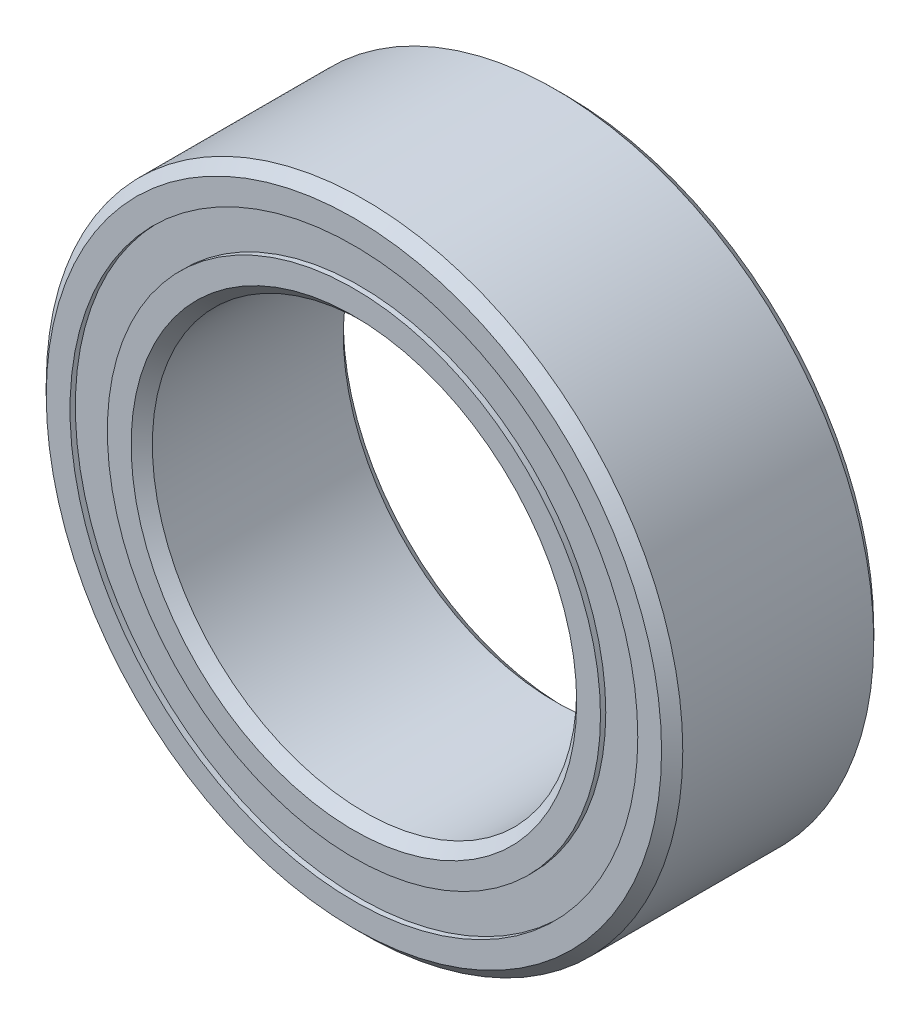
ISO-10303-21;
HEADER;
FILE_DESCRIPTION(('STEP AP214'),'2;1');
FILE_NAME('part.step','',(''),(''),'','','');
FILE_SCHEMA(('AUTOMOTIVE_DESIGN { 1 0 10303 214 1 1 1 1 }'));
ENDSEC;
DATA;
#1=APPLICATION_CONTEXT('core data for automotive mechanical design processes');
#2=APPLICATION_PROTOCOL_DEFINITION('international standard','automotive_design',2000,#1);
#3=PRODUCT_CONTEXT('',#1,'mechanical');
#4=PRODUCT('Part','Part','',(#3));
#5=PRODUCT_RELATED_PRODUCT_CATEGORY('part','',(#4));
#6=PRODUCT_DEFINITION_FORMATION('','',#4);
#7=PRODUCT_DEFINITION_CONTEXT('part definition',#1,'design');
#8=PRODUCT_DEFINITION('design','',#6,#7);
#9=PRODUCT_DEFINITION_SHAPE('','',#8);
#10=(LENGTH_UNIT() NAMED_UNIT(*) SI_UNIT(.MILLI.,.METRE.));
#11=(NAMED_UNIT(*) PLANE_ANGLE_UNIT() SI_UNIT($,.RADIAN.));
#12=(NAMED_UNIT(*) SI_UNIT($,.STERADIAN.) SOLID_ANGLE_UNIT());
#13=UNCERTAINTY_MEASURE_WITH_UNIT(LENGTH_MEASURE(1.E-05),#10,'distance_accuracy_value','');
#14=(GEOMETRIC_REPRESENTATION_CONTEXT(3) GLOBAL_UNCERTAINTY_ASSIGNED_CONTEXT((#13)) GLOBAL_UNIT_ASSIGNED_CONTEXT((#10,
#11,#12)) REPRESENTATION_CONTEXT('',''));
#15=CARTESIAN_POINT('',(0.,0.,0.));
#16=DIRECTION('',(0.,0.,1.));
#17=DIRECTION('',(1.,0.,0.));
#18=AXIS2_PLACEMENT_3D('',#15,#16,#17);
#19=CARTESIAN_POINT('',(3.96875,0.,0.));
#20=DIRECTION('',(1.,0.,0.));
#21=DIRECTION('',(0.,0.,-1.));
#22=AXIS2_PLACEMENT_3D('',#19,#20,#21);
#23=SPHERICAL_SURFACE('',#22,0.758760243513404);
#24=CARTESIAN_POINT('',(3.2099897564866,0.,0.));
#25=VERTEX_POINT('',#24);
#26=VERTEX_LOOP('',#25);
#27=FACE_BOUND('',#26,.T.);
#28=CARTESIAN_POINT('',(4.7275102435134,0.,0.));
#29=VERTEX_POINT('',#28);
#30=VERTEX_LOOP('',#29);
#31=FACE_BOUND('',#30,.T.);
#32=ADVANCED_FACE('P0_F16',(#27,#31),#23,.T.);
#33=CLOSED_SHELL('',(#32));
#34=MANIFOLD_SOLID_BREP('P0_B1',#33);
#35=CARTESIAN_POINT('',(0.,3.96875,0.));
#36=DIRECTION('',(0.,1.,0.));
#37=DIRECTION('',(0.,0.,-1.));
#38=AXIS2_PLACEMENT_3D('',#35,#36,#37);
#39=SPHERICAL_SURFACE('',#38,0.758760243513404);
#40=CARTESIAN_POINT('',(0.,3.2099897564866,0.));
#41=VERTEX_POINT('',#40);
#42=VERTEX_LOOP('',#41);
#43=FACE_BOUND('',#42,.T.);
#44=CARTESIAN_POINT('',(0.,4.7275102435134,0.));
#45=VERTEX_POINT('',#44);
#46=VERTEX_LOOP('',#45);
#47=FACE_BOUND('',#46,.T.);
#48=ADVANCED_FACE('P1_F16',(#43,#47),#39,.T.);
#49=CLOSED_SHELL('',(#48));
#50=MANIFOLD_SOLID_BREP('P1_B1',#49);
#51=CARTESIAN_POINT('',(0.,0.,0.));
#52=DIRECTION('',(0.,0.,1.));
#53=DIRECTION('',(1.,0.,0.));
#54=AXIS2_PLACEMENT_3D('',#51,#52,#53);
#55=TOROIDAL_SURFACE('',#54,3.96875,0.758760243513404);
#56=CARTESIAN_POINT('',(0.,0.,-0.705555555555556));
#57=DIRECTION('',(0.,0.,1.));
#58=DIRECTION('',(1.,0.,0.));
#59=AXIS2_PLACEMENT_3D('',#56,#57,#58);
#60=CIRCLE('',#59,4.24787087912088);
#61=CARTESIAN_POINT('',(4.24787087912088,0.,-0.705555555555556));
#62=VERTEX_POINT('',#61);
#63=EDGE_CURVE('P2_E33',#62,#62,#60,.F.);
#64=ORIENTED_EDGE('',*,*,#63,.T.);
#65=EDGE_LOOP('',(#64));
#66=FACE_BOUND('',#65,.T.);
#67=CARTESIAN_POINT('',(0.,0.,0.705555555555555));
#68=DIRECTION('',(0.,0.,1.));
#69=DIRECTION('',(1.,0.,0.));
#70=AXIS2_PLACEMENT_3D('',#67,#68,#69);
#71=CIRCLE('',#70,4.24787087912088);
#72=CARTESIAN_POINT('',(4.24787087912088,0.,0.705555555555555));
#73=VERTEX_POINT('',#72);
#74=EDGE_CURVE('P2_E31',#73,#73,#71,.T.);
#75=ORIENTED_EDGE('',*,*,#74,.T.);
#76=EDGE_LOOP('',(#75));
#77=FACE_BOUND('',#76,.T.);
#78=ADVANCED_FACE('P2_F15',(#66,#77),#55,.F.);
#79=CARTESIAN_POINT('',(0.,0.,1.5875));
#80=DIRECTION('',(0.,0.,1.));
#81=DIRECTION('',(1.,0.,0.));
#82=AXIS2_PLACEMENT_3D('',#79,#80,#81);
#83=CYLINDRICAL_SURFACE('',#82,4.24787087912088);
#84=CARTESIAN_POINT('',(0.,0.,-1.5875));
#85=DIRECTION('',(0.,0.,1.));
#86=DIRECTION('',(1.,0.,0.));
#87=AXIS2_PLACEMENT_3D('',#84,#85,#86);
#88=CIRCLE('',#87,4.24787087912088);
#89=CARTESIAN_POINT('',(4.24787087912088,0.,-1.5875));
#90=VERTEX_POINT('',#89);
#91=EDGE_CURVE('P2_E19',#90,#90,#88,.F.);
#92=ORIENTED_EDGE('',*,*,#91,.T.);
#93=EDGE_LOOP('',(#92));
#94=FACE_BOUND('',#93,.T.);
#95=ORIENTED_EDGE('',*,*,#63,.F.);
#96=EDGE_LOOP('',(#95));
#97=FACE_BOUND('',#96,.T.);
#98=ADVANCED_FACE('P2_F49',(#94,#97),#83,.F.);
#99=CARTESIAN_POINT('',(0.,0.,1.5875));
#100=DIRECTION('',(0.,0.,1.));
#101=DIRECTION('',(1.,0.,0.));
#102=AXIS2_PLACEMENT_3D('',#99,#100,#101);
#103=CYLINDRICAL_SURFACE('',#102,4.24787087912088);
#104=ORIENTED_EDGE('',*,*,#74,.F.);
#105=EDGE_LOOP('',(#104));
#106=FACE_BOUND('',#105,.T.);
#107=CARTESIAN_POINT('',(0.,0.,1.5875));
#108=DIRECTION('',(0.,0.,1.));
#109=DIRECTION('',(1.,0.,0.));
#110=AXIS2_PLACEMENT_3D('',#107,#108,#109);
#111=CIRCLE('',#110,4.24787087912088);
#112=CARTESIAN_POINT('',(4.24787087912088,0.,1.5875));
#113=VERTEX_POINT('',#112);
#114=EDGE_CURVE('P2_E42',#113,#113,#111,.T.);
#115=ORIENTED_EDGE('',*,*,#114,.T.);
#116=EDGE_LOOP('',(#115));
#117=FACE_BOUND('',#116,.T.);
#118=ADVANCED_FACE('P2_F56',(#106,#117),#103,.F.);
#119=CARTESIAN_POINT('',(0.,4.60375,-1.5875));
#120=DIRECTION('',(0.,0.,1.));
#121=DIRECTION('',(1.,0.,0.));
#122=AXIS2_PLACEMENT_3D('',#119,#120,#121);
#123=PLANE('',#122);
#124=ORIENTED_EDGE('',*,*,#91,.F.);
#125=EDGE_LOOP('',(#124));
#126=FACE_BOUND('',#125,.T.);
#127=CARTESIAN_POINT('',(0.,0.,-1.58750000002783));
#128=DIRECTION('',(0.,0.,1.));
#129=DIRECTION('',(1.,0.,0.));
#130=AXIS2_PLACEMENT_3D('',#127,#128,#129);
#131=CIRCLE('',#130,4.60375000000113);
#132=CARTESIAN_POINT('',(4.60375000000113,0.,-1.58750000002783));
#133=VERTEX_POINT('',#132);
#134=EDGE_CURVE('P2_E40',#133,#133,#131,.T.);
#135=ORIENTED_EDGE('',*,*,#134,.F.);
#136=EDGE_LOOP('',(#135));
#137=FACE_BOUND('',#136,.T.);
#138=ADVANCED_FACE('P2_F52',(#126,#137),#123,.F.);
#139=CARTESIAN_POINT('',(0.,4.60375,1.5875));
#140=DIRECTION('',(0.,0.,-1.));
#141=DIRECTION('',(-1.,0.,0.));
#142=AXIS2_PLACEMENT_3D('',#139,#140,#141);
#143=PLANE('',#142);
#144=CARTESIAN_POINT('',(0.,0.,1.58750000008467));
#145=DIRECTION('',(0.,0.,-1.));
#146=DIRECTION('',(-1.,0.,0.));
#147=AXIS2_PLACEMENT_3D('',#144,#145,#146);
#148=CIRCLE('',#147,4.60375000000113);
#149=CARTESIAN_POINT('',(-4.60375000000113,0.,1.58750000008467));
#150=VERTEX_POINT('',#149);
#151=EDGE_CURVE('P2_E28',#150,#150,#148,.T.);
#152=ORIENTED_EDGE('',*,*,#151,.F.);
#153=EDGE_LOOP('',(#152));
#154=FACE_BOUND('',#153,.T.);
#155=ORIENTED_EDGE('',*,*,#114,.F.);
#156=EDGE_LOOP('',(#155));
#157=FACE_BOUND('',#156,.T.);
#158=ADVANCED_FACE('P2_F55',(#154,#157),#143,.F.);
#159=CARTESIAN_POINT('',(0.,0.,-1.42874999994547));
#160=DIRECTION('',(0.,0.,1.));
#161=DIRECTION('',(1.,0.,0.));
#162=AXIS2_PLACEMENT_3D('',#159,#160,#161);
#163=CONICAL_SURFACE('',#162,4.76250000002665,0.785398163218414);
#164=CARTESIAN_POINT('',(0.,0.,-1.42875));
#165=DIRECTION('',(0.,0.,1.));
#166=DIRECTION('',(1.,0.,0.));
#167=AXIS2_PLACEMENT_3D('',#164,#165,#166);
#168=CIRCLE('',#167,4.7625);
#169=CARTESIAN_POINT('',(4.7625,0.,-1.42875));
#170=VERTEX_POINT('',#169);
#171=EDGE_CURVE('P2_E23',#170,#170,#168,.T.);
#172=ORIENTED_EDGE('',*,*,#171,.F.);
#173=EDGE_LOOP('',(#172));
#174=FACE_BOUND('',#173,.T.);
#175=ORIENTED_EDGE('',*,*,#134,.T.);
#176=EDGE_LOOP('',(#175));
#177=FACE_BOUND('',#176,.T.);
#178=ADVANCED_FACE('P2_F60',(#174,#177),#163,.T.);
#179=CARTESIAN_POINT('',(0.,0.,1.42875000005915));
#180=DIRECTION('',(0.,0.,-1.));
#181=DIRECTION('',(-1.,0.,0.));
#182=AXIS2_PLACEMENT_3D('',#179,#180,#181);
#183=CONICAL_SURFACE('',#182,4.7624999999698,0.785398163218414);
#184=CARTESIAN_POINT('',(0.,0.,1.42875));
#185=DIRECTION('',(0.,0.,1.));
#186=DIRECTION('',(1.,0.,0.));
#187=AXIS2_PLACEMENT_3D('',#184,#185,#186);
#188=CIRCLE('',#187,4.7625);
#189=CARTESIAN_POINT('',(4.7625,0.,1.42875));
#190=VERTEX_POINT('',#189);
#191=EDGE_CURVE('P2_E10',#190,#190,#188,.F.);
#192=ORIENTED_EDGE('',*,*,#191,.F.);
#193=EDGE_LOOP('',(#192));
#194=FACE_BOUND('',#193,.T.);
#195=ORIENTED_EDGE('',*,*,#151,.T.);
#196=EDGE_LOOP('',(#195));
#197=FACE_BOUND('',#196,.T.);
#198=ADVANCED_FACE('P2_F62',(#194,#197),#183,.T.);
#199=CARTESIAN_POINT('',(0.,0.,1.5875));
#200=DIRECTION('',(0.,0.,1.));
#201=DIRECTION('',(1.,0.,0.));
#202=AXIS2_PLACEMENT_3D('',#199,#200,#201);
#203=CYLINDRICAL_SURFACE('',#202,4.7625);
#204=ORIENTED_EDGE('',*,*,#191,.T.);
#205=EDGE_LOOP('',(#204));
#206=FACE_BOUND('',#205,.T.);
#207=ORIENTED_EDGE('',*,*,#171,.T.);
#208=EDGE_LOOP('',(#207));
#209=FACE_BOUND('',#208,.T.);
#210=ADVANCED_FACE('P2_F70',(#206,#209),#203,.T.);
#211=CLOSED_SHELL('',(#78,#98,#118,#138,#158,#178,#198,#210));
#212=MANIFOLD_SOLID_BREP('P2_B1',#211);
#213=CARTESIAN_POINT('',(1.98437499999998,-3.4370383212695,0.));
#214=DIRECTION('',(0.499999999999995,-0.866025403784442,0.));
#215=DIRECTION('',(0.,0.,-1.));
#216=AXIS2_PLACEMENT_3D('',#213,#214,#215);
#217=SPHERICAL_SURFACE('',#216,0.758760243513404);
#218=CARTESIAN_POINT('',(2.36375512175668,-4.09414396753378,0.));
#219=VERTEX_POINT('',#218);
#220=VERTEX_LOOP('',#219);
#221=FACE_BOUND('',#220,.T.);
#222=CARTESIAN_POINT('',(1.60499487824328,-2.77993267500523,0.));
#223=VERTEX_POINT('',#222);
#224=VERTEX_LOOP('',#223);
#225=FACE_BOUND('',#224,.T.);
#226=ADVANCED_FACE('P3_F15',(#221,#225),#217,.T.);
#227=CLOSED_SHELL('',(#226));
#228=MANIFOLD_SOLID_BREP('P3_B1',#227);
#229=CARTESIAN_POINT('',(-3.96875,0.,0.));
#230=DIRECTION('',(-1.,0.,0.));
#231=DIRECTION('',(0.,0.,-1.));
#232=AXIS2_PLACEMENT_3D('',#229,#230,#231);
#233=SPHERICAL_SURFACE('',#232,0.758760243513404);
#234=CARTESIAN_POINT('',(-4.7275102435134,0.,0.));
#235=VERTEX_POINT('',#234);
#236=VERTEX_LOOP('',#235);
#237=FACE_BOUND('',#236,.T.);
#238=CARTESIAN_POINT('',(-3.2099897564866,0.,0.));
#239=VERTEX_POINT('',#238);
#240=VERTEX_LOOP('',#239);
#241=FACE_BOUND('',#240,.T.);
#242=ADVANCED_FACE('P4_F16',(#237,#241),#233,.T.);
#243=CLOSED_SHELL('',(#242));
#244=MANIFOLD_SOLID_BREP('P4_B1',#243);
#245=CARTESIAN_POINT('',(-3.43703832126951,-1.98437499999997,0.));
#246=DIRECTION('',(-0.866025403784443,-0.499999999999992,0.));
#247=DIRECTION('',(0.,0.,-1.));
#248=AXIS2_PLACEMENT_3D('',#245,#246,#247);
#249=SPHERICAL_SURFACE('',#248,0.758760243513404);
#250=CARTESIAN_POINT('',(-4.09414396753379,-2.36375512175666,0.));
#251=VERTEX_POINT('',#250);
#252=VERTEX_LOOP('',#251);
#253=FACE_BOUND('',#252,.T.);
#254=CARTESIAN_POINT('',(-2.77993267500523,-1.60499487824327,0.));
#255=VERTEX_POINT('',#254);
#256=VERTEX_LOOP('',#255);
#257=FACE_BOUND('',#256,.T.);
#258=ADVANCED_FACE('P5_F16',(#253,#257),#249,.T.);
#259=CLOSED_SHELL('',(#258));
#260=MANIFOLD_SOLID_BREP('P5_B1',#259);
#261=CARTESIAN_POINT('',(1.984375,3.43703832126949,0.));
#262=DIRECTION('',(0.500000000000001,0.866025403784438,0.));
#263=DIRECTION('',(0.,0.,-1.));
#264=AXIS2_PLACEMENT_3D('',#261,#262,#263);
#265=SPHERICAL_SURFACE('',#264,0.758760243513404);
#266=CARTESIAN_POINT('',(2.36375512175671,4.09414396753376,0.));
#267=VERTEX_POINT('',#266);
#268=VERTEX_LOOP('',#267);
#269=FACE_BOUND('',#268,.T.);
#270=CARTESIAN_POINT('',(1.6049948782433,2.77993267500521,0.));
#271=VERTEX_POINT('',#270);
#272=VERTEX_LOOP('',#271);
#273=FACE_BOUND('',#272,.T.);
#274=ADVANCED_FACE('P6_F16',(#269,#273),#265,.T.);
#275=CLOSED_SHELL('',(#274));
#276=MANIFOLD_SOLID_BREP('P6_B1',#275);
#277=CARTESIAN_POINT('',(-1.98437499999996,3.43703832126952,0.));
#278=DIRECTION('',(-0.499999999999989,0.866025403784445,0.));
#279=DIRECTION('',(0.,0.,-1.));
#280=AXIS2_PLACEMENT_3D('',#277,#278,#279);
#281=SPHERICAL_SURFACE('',#280,0.758760243513404);
#282=CARTESIAN_POINT('',(-2.36375512175665,4.0941439675338,0.));
#283=VERTEX_POINT('',#282);
#284=VERTEX_LOOP('',#283);
#285=FACE_BOUND('',#284,.T.);
#286=CARTESIAN_POINT('',(-1.60499487824326,2.77993267500524,0.));
#287=VERTEX_POINT('',#286);
#288=VERTEX_LOOP('',#287);
#289=FACE_BOUND('',#288,.T.);
#290=ADVANCED_FACE('P7_F16',(#285,#289),#281,.T.);
#291=CLOSED_SHELL('',(#290));
#292=MANIFOLD_SOLID_BREP('P7_B1',#291);
#293=CARTESIAN_POINT('',(0.,0.,0.));
#294=DIRECTION('',(0.,0.,1.));
#295=DIRECTION('',(1.,0.,0.));
#296=AXIS2_PLACEMENT_3D('',#293,#294,#295);
#297=TOROIDAL_SURFACE('',#296,3.96875,0.758760243513403);
#298=CARTESIAN_POINT('',(0.,0.,0.705555555555556));
#299=DIRECTION('',(0.,0.,1.));
#300=DIRECTION('',(1.,0.,0.));
#301=AXIS2_PLACEMENT_3D('',#298,#299,#300);
#302=CIRCLE('',#301,3.68962912087912);
#303=CARTESIAN_POINT('',(3.68962912087912,0.,0.705555555555556));
#304=VERTEX_POINT('',#303);
#305=EDGE_CURVE('P8_E33',#304,#304,#302,.T.);
#306=ORIENTED_EDGE('',*,*,#305,.F.);
#307=EDGE_LOOP('',(#306));
#308=FACE_BOUND('',#307,.T.);
#309=CARTESIAN_POINT('',(0.,0.,-0.705555555555556));
#310=DIRECTION('',(0.,0.,1.));
#311=DIRECTION('',(1.,0.,0.));
#312=AXIS2_PLACEMENT_3D('',#309,#310,#311);
#313=CIRCLE('',#312,3.68962912087912);
#314=CARTESIAN_POINT('',(3.68962912087912,0.,-0.705555555555556));
#315=VERTEX_POINT('',#314);
#316=EDGE_CURVE('P8_E31',#315,#315,#313,.F.);
#317=ORIENTED_EDGE('',*,*,#316,.F.);
#318=EDGE_LOOP('',(#317));
#319=FACE_BOUND('',#318,.T.);
#320=ADVANCED_FACE('P8_F15',(#308,#319),#297,.F.);
#321=CARTESIAN_POINT('',(0.,0.,1.5875));
#322=DIRECTION('',(0.,0.,1.));
#323=DIRECTION('',(1.,0.,0.));
#324=AXIS2_PLACEMENT_3D('',#321,#322,#323);
#325=CYLINDRICAL_SURFACE('',#324,3.68962912087912);
#326=CARTESIAN_POINT('',(0.,0.,1.5875));
#327=DIRECTION('',(0.,0.,1.));
#328=DIRECTION('',(1.,0.,0.));
#329=AXIS2_PLACEMENT_3D('',#326,#327,#328);
#330=CIRCLE('',#329,3.68962912087912);
#331=CARTESIAN_POINT('',(3.68962912087912,0.,1.5875));
#332=VERTEX_POINT('',#331);
#333=EDGE_CURVE('P8_E19',#332,#332,#330,.F.);
#334=ORIENTED_EDGE('',*,*,#333,.T.);
#335=EDGE_LOOP('',(#334));
#336=FACE_BOUND('',#335,.T.);
#337=ORIENTED_EDGE('',*,*,#305,.T.);
#338=EDGE_LOOP('',(#337));
#339=FACE_BOUND('',#338,.T.);
#340=ADVANCED_FACE('P8_F49',(#336,#339),#325,.T.);
#341=CARTESIAN_POINT('',(0.,0.,1.5875));
#342=DIRECTION('',(0.,0.,1.));
#343=DIRECTION('',(1.,0.,0.));
#344=AXIS2_PLACEMENT_3D('',#341,#342,#343);
#345=CYLINDRICAL_SURFACE('',#344,3.68962912087912);
#346=ORIENTED_EDGE('',*,*,#316,.T.);
#347=EDGE_LOOP('',(#346));
#348=FACE_BOUND('',#347,.T.);
#349=CARTESIAN_POINT('',(0.,0.,-1.5875));
#350=DIRECTION('',(0.,0.,1.));
#351=DIRECTION('',(1.,0.,0.));
#352=AXIS2_PLACEMENT_3D('',#349,#350,#351);
#353=CIRCLE('',#352,3.68962912087912);
#354=CARTESIAN_POINT('',(3.68962912087912,0.,-1.5875));
#355=VERTEX_POINT('',#354);
#356=EDGE_CURVE('P8_E42',#355,#355,#353,.T.);
#357=ORIENTED_EDGE('',*,*,#356,.T.);
#358=EDGE_LOOP('',(#357));
#359=FACE_BOUND('',#358,.T.);
#360=ADVANCED_FACE('P8_F56',(#348,#359),#345,.T.);
#361=CARTESIAN_POINT('',(0.,3.68962912087912,1.5875));
#362=DIRECTION('',(0.,0.,-1.));
#363=DIRECTION('',(-1.,0.,0.));
#364=AXIS2_PLACEMENT_3D('',#361,#362,#363);
#365=PLANE('',#364);
#366=ORIENTED_EDGE('',*,*,#333,.F.);
#367=EDGE_LOOP('',(#366));
#368=FACE_BOUND('',#367,.T.);
#369=CARTESIAN_POINT('',(0.,0.,1.58749999997099));
#370=DIRECTION('',(0.,0.,1.));
#371=DIRECTION('',(1.,0.,0.));
#372=AXIS2_PLACEMENT_3D('',#369,#370,#371);
#373=CIRCLE('',#372,3.33374999996749);
#374=CARTESIAN_POINT('',(3.33374999996749,0.,1.58749999997099));
#375=VERTEX_POINT('',#374);
#376=EDGE_CURVE('P8_E40',#375,#375,#373,.F.);
#377=ORIENTED_EDGE('',*,*,#376,.T.);
#378=EDGE_LOOP('',(#377));
#379=FACE_BOUND('',#378,.T.);
#380=ADVANCED_FACE('P8_F52',(#368,#379),#365,.F.);
#381=CARTESIAN_POINT('',(0.,3.33375,-1.5875));
#382=DIRECTION('',(0.,0.,1.));
#383=DIRECTION('',(1.,0.,0.));
#384=AXIS2_PLACEMENT_3D('',#381,#382,#383);
#385=PLANE('',#384);
#386=CARTESIAN_POINT('',(0.,0.,-1.58749999997099));
#387=DIRECTION('',(0.,0.,-1.));
#388=DIRECTION('',(0.,1.,0.));
#389=AXIS2_PLACEMENT_3D('',#386,#387,#388);
#390=CIRCLE('',#389,3.33375000002434);
#391=CARTESIAN_POINT('',(0.,3.33375000002434,-1.58749999997099));
#392=VERTEX_POINT('',#391);
#393=EDGE_CURVE('P8_E28',#392,#392,#390,.F.);
#394=ORIENTED_EDGE('',*,*,#393,.T.);
#395=EDGE_LOOP('',(#394));
#396=FACE_BOUND('',#395,.T.);
#397=ORIENTED_EDGE('',*,*,#356,.F.);
#398=EDGE_LOOP('',(#397));
#399=FACE_BOUND('',#398,.T.);
#400=ADVANCED_FACE('P8_F55',(#396,#399),#385,.F.);
#401=CARTESIAN_POINT('',(0.,0.,1.58749999991414));
#402=DIRECTION('',(0.,0.,1.));
#403=DIRECTION('',(1.,0.,0.));
#404=AXIS2_PLACEMENT_3D('',#401,#402,#403);
#405=CONICAL_SURFACE('',#404,3.33374999991065,0.785398163397448);
#406=ORIENTED_EDGE('',*,*,#376,.F.);
#407=EDGE_LOOP('',(#406));
#408=FACE_BOUND('',#407,.T.);
#409=CARTESIAN_POINT('',(0.,0.,1.42875));
#410=DIRECTION('',(0.,0.,1.));
#411=DIRECTION('',(1.,0.,0.));
#412=AXIS2_PLACEMENT_3D('',#409,#410,#411);
#413=CIRCLE('',#412,3.175);
#414=CARTESIAN_POINT('',(3.175,0.,1.42875));
#415=VERTEX_POINT('',#414);
#416=EDGE_CURVE('P8_E23',#415,#415,#413,.F.);
#417=ORIENTED_EDGE('',*,*,#416,.T.);
#418=EDGE_LOOP('',(#417));
#419=FACE_BOUND('',#418,.T.);
#420=ADVANCED_FACE('P8_F60',(#408,#419),#405,.F.);
#421=CARTESIAN_POINT('',(0.,0.,-1.58749999997099));
#422=DIRECTION('',(0.,0.,-1.));
#423=DIRECTION('',(0.,1.,0.));
#424=AXIS2_PLACEMENT_3D('',#421,#422,#423);
#425=CONICAL_SURFACE('',#424,3.33375000002434,0.785398163397448);
#426=CARTESIAN_POINT('',(0.,0.,-1.42875));
#427=DIRECTION('',(0.,0.,1.));
#428=DIRECTION('',(1.,0.,0.));
#429=AXIS2_PLACEMENT_3D('',#426,#427,#428);
#430=CIRCLE('',#429,3.175);
#431=CARTESIAN_POINT('',(3.175,0.,-1.42875));
#432=VERTEX_POINT('',#431);
#433=EDGE_CURVE('P8_E10',#432,#432,#430,.T.);
#434=ORIENTED_EDGE('',*,*,#433,.T.);
#435=EDGE_LOOP('',(#434));
#436=FACE_BOUND('',#435,.T.);
#437=ORIENTED_EDGE('',*,*,#393,.F.);
#438=EDGE_LOOP('',(#437));
#439=FACE_BOUND('',#438,.T.);
#440=ADVANCED_FACE('P8_F63',(#436,#439),#425,.F.);
#441=CARTESIAN_POINT('',(0.,0.,1.5875));
#442=DIRECTION('',(0.,0.,1.));
#443=DIRECTION('',(1.,0.,0.));
#444=AXIS2_PLACEMENT_3D('',#441,#442,#443);
#445=CYLINDRICAL_SURFACE('',#444,3.175);
#446=ORIENTED_EDGE('',*,*,#416,.F.);
#447=EDGE_LOOP('',(#446));
#448=FACE_BOUND('',#447,.T.);
#449=ORIENTED_EDGE('',*,*,#433,.F.);
#450=EDGE_LOOP('',(#449));
#451=FACE_BOUND('',#450,.T.);
#452=ADVANCED_FACE('P8_F67',(#448,#451),#445,.F.);
#453=CLOSED_SHELL('',(#320,#340,#360,#380,#400,#420,#440,#452));
#454=MANIFOLD_SOLID_BREP('P8_B1',#453);
#455=CARTESIAN_POINT('',(0.,4.24787087912088,-1.508125));
#456=DIRECTION('',(0.,0.,1.));
#457=DIRECTION('',(1.,0.,0.));
#458=AXIS2_PLACEMENT_3D('',#455,#456,#457);
#459=PLANE('',#458);
#460=CARTESIAN_POINT('',(0.,0.,-1.508125));
#461=DIRECTION('',(0.,0.,1.));
#462=DIRECTION('',(1.,0.,0.));
#463=AXIS2_PLACEMENT_3D('',#460,#461,#462);
#464=CIRCLE('',#463,3.68962912087912);
#465=CARTESIAN_POINT('',(3.68962912087912,0.,-1.508125));
#466=VERTEX_POINT('',#465);
#467=EDGE_CURVE('P9_E18',#466,#466,#464,.T.);
#468=ORIENTED_EDGE('',*,*,#467,.T.);
#469=EDGE_LOOP('',(#468));
#470=FACE_BOUND('',#469,.T.);
#471=CARTESIAN_POINT('',(0.,0.,-1.508125));
#472=DIRECTION('',(0.,0.,1.));
#473=DIRECTION('',(1.,0.,0.));
#474=AXIS2_PLACEMENT_3D('',#471,#472,#473);
#475=CIRCLE('',#474,4.24787087912088);
#476=CARTESIAN_POINT('',(4.24787087912088,0.,-1.508125));
#477=VERTEX_POINT('',#476);
#478=EDGE_CURVE('P9_E27',#477,#477,#475,.T.);
#479=ORIENTED_EDGE('',*,*,#478,.F.);
#480=EDGE_LOOP('',(#479));
#481=FACE_BOUND('',#480,.T.);
#482=ADVANCED_FACE('P9_F15',(#470,#481),#459,.F.);
#483=CARTESIAN_POINT('',(0.,0.,1.5875));
#484=DIRECTION('',(0.,0.,1.));
#485=DIRECTION('',(1.,0.,0.));
#486=AXIS2_PLACEMENT_3D('',#483,#484,#485);
#487=CYLINDRICAL_SURFACE('',#486,3.68962912087912);
#488=ORIENTED_EDGE('',*,*,#467,.F.);
#489=EDGE_LOOP('',(#488));
#490=FACE_BOUND('',#489,.T.);
#491=CARTESIAN_POINT('',(0.,0.,-0.758760243513405));
#492=DIRECTION('',(0.,0.,1.));
#493=DIRECTION('',(1.,0.,0.));
#494=AXIS2_PLACEMENT_3D('',#491,#492,#493);
#495=CIRCLE('',#494,3.68962912087912);
#496=CARTESIAN_POINT('',(3.68962912087912,0.,-0.758760243513405));
#497=VERTEX_POINT('',#496);
#498=EDGE_CURVE('P9_E22',#497,#497,#495,.T.);
#499=ORIENTED_EDGE('',*,*,#498,.T.);
#500=EDGE_LOOP('',(#499));
#501=FACE_BOUND('',#500,.T.);
#502=ADVANCED_FACE('P9_F37',(#490,#501),#487,.F.);
#503=CARTESIAN_POINT('',(0.,0.,1.5875));
#504=DIRECTION('',(0.,0.,1.));
#505=DIRECTION('',(1.,0.,0.));
#506=AXIS2_PLACEMENT_3D('',#503,#504,#505);
#507=CYLINDRICAL_SURFACE('',#506,4.24787087912088);
#508=CARTESIAN_POINT('',(0.,0.,-0.758760243513404));
#509=DIRECTION('',(0.,0.,1.));
#510=DIRECTION('',(1.,0.,0.));
#511=AXIS2_PLACEMENT_3D('',#508,#509,#510);
#512=CIRCLE('',#511,4.24787087912088);
#513=CARTESIAN_POINT('',(4.24787087912088,0.,-0.758760243513404));
#514=VERTEX_POINT('',#513);
#515=EDGE_CURVE('P9_E10',#514,#514,#512,.F.);
#516=ORIENTED_EDGE('',*,*,#515,.T.);
#517=EDGE_LOOP('',(#516));
#518=FACE_BOUND('',#517,.T.);
#519=ORIENTED_EDGE('',*,*,#478,.T.);
#520=EDGE_LOOP('',(#519));
#521=FACE_BOUND('',#520,.T.);
#522=ADVANCED_FACE('P9_F40',(#518,#521),#507,.T.);
#523=CARTESIAN_POINT('',(0.,4.24787087912088,-0.758760243513404));
#524=DIRECTION('',(0.,0.,-1.));
#525=DIRECTION('',(-1.,0.,0.));
#526=AXIS2_PLACEMENT_3D('',#523,#524,#525);
#527=PLANE('',#526);
#528=ORIENTED_EDGE('',*,*,#515,.F.);
#529=EDGE_LOOP('',(#528));
#530=FACE_BOUND('',#529,.T.);
#531=ORIENTED_EDGE('',*,*,#498,.F.);
#532=EDGE_LOOP('',(#531));
#533=FACE_BOUND('',#532,.T.);
#534=ADVANCED_FACE('P9_F43',(#530,#533),#527,.F.);
#535=CLOSED_SHELL('',(#482,#502,#522,#534));
#536=MANIFOLD_SOLID_BREP('P9_B1',#535);
#537=CARTESIAN_POINT('',(3.4370383212695,1.98437499999999,0.));
#538=DIRECTION('',(0.86602540378444,0.499999999999998,0.));
#539=DIRECTION('',(0.,0.,-1.));
#540=AXIS2_PLACEMENT_3D('',#537,#538,#539);
#541=SPHERICAL_SURFACE('',#540,0.758760243513404);
#542=CARTESIAN_POINT('',(4.09414396753377,2.36375512175669,0.));
#543=VERTEX_POINT('',#542);
#544=VERTEX_LOOP('',#543);
#545=FACE_BOUND('',#544,.T.);
#546=CARTESIAN_POINT('',(2.77993267500522,1.60499487824329,0.));
#547=VERTEX_POINT('',#546);
#548=VERTEX_LOOP('',#547);
#549=FACE_BOUND('',#548,.T.);
#550=ADVANCED_FACE('P10_F16',(#545,#549),#541,.T.);
#551=CLOSED_SHELL('',(#550));
#552=MANIFOLD_SOLID_BREP('P10_B1',#551);
#553=CARTESIAN_POINT('',(0.,4.24787087912088,0.758760243513404));
#554=DIRECTION('',(0.,0.,1.));
#555=DIRECTION('',(1.,0.,0.));
#556=AXIS2_PLACEMENT_3D('',#553,#554,#555);
#557=PLANE('',#556);
#558=CARTESIAN_POINT('',(0.,0.,0.758760243513404));
#559=DIRECTION('',(0.,0.,1.));
#560=DIRECTION('',(1.,0.,0.));
#561=AXIS2_PLACEMENT_3D('',#558,#559,#560);
#562=CIRCLE('',#561,3.68962912087912);
#563=CARTESIAN_POINT('',(3.68962912087912,0.,0.758760243513404));
#564=VERTEX_POINT('',#563);
#565=EDGE_CURVE('P11_E18',#564,#564,#562,.T.);
#566=ORIENTED_EDGE('',*,*,#565,.T.);
#567=EDGE_LOOP('',(#566));
#568=FACE_BOUND('',#567,.T.);
#569=CARTESIAN_POINT('',(0.,0.,0.758760243513404));
#570=DIRECTION('',(0.,0.,1.));
#571=DIRECTION('',(1.,0.,0.));
#572=AXIS2_PLACEMENT_3D('',#569,#570,#571);
#573=CIRCLE('',#572,4.24787087912088);
#574=CARTESIAN_POINT('',(4.24787087912088,0.,0.758760243513404));
#575=VERTEX_POINT('',#574);
#576=EDGE_CURVE('P11_E27',#575,#575,#573,.T.);
#577=ORIENTED_EDGE('',*,*,#576,.F.);
#578=EDGE_LOOP('',(#577));
#579=FACE_BOUND('',#578,.T.);
#580=ADVANCED_FACE('P11_F15',(#568,#579),#557,.F.);
#581=CARTESIAN_POINT('',(0.,0.,1.5875));
#582=DIRECTION('',(0.,0.,1.));
#583=DIRECTION('',(1.,0.,0.));
#584=AXIS2_PLACEMENT_3D('',#581,#582,#583);
#585=CYLINDRICAL_SURFACE('',#584,3.68962912087912);
#586=ORIENTED_EDGE('',*,*,#565,.F.);
#587=EDGE_LOOP('',(#586));
#588=FACE_BOUND('',#587,.T.);
#589=CARTESIAN_POINT('',(0.,0.,1.508125));
#590=DIRECTION('',(0.,0.,1.));
#591=DIRECTION('',(1.,0.,0.));
#592=AXIS2_PLACEMENT_3D('',#589,#590,#591);
#593=CIRCLE('',#592,3.68962912087912);
#594=CARTESIAN_POINT('',(3.68962912087912,0.,1.508125));
#595=VERTEX_POINT('',#594);
#596=EDGE_CURVE('P11_E22',#595,#595,#593,.T.);
#597=ORIENTED_EDGE('',*,*,#596,.T.);
#598=EDGE_LOOP('',(#597));
#599=FACE_BOUND('',#598,.T.);
#600=ADVANCED_FACE('P11_F37',(#588,#599),#585,.F.);
#601=CARTESIAN_POINT('',(0.,0.,1.5875));
#602=DIRECTION('',(0.,0.,1.));
#603=DIRECTION('',(1.,0.,0.));
#604=AXIS2_PLACEMENT_3D('',#601,#602,#603);
#605=CYLINDRICAL_SURFACE('',#604,4.24787087912088);
#606=CARTESIAN_POINT('',(0.,0.,1.508125));
#607=DIRECTION('',(0.,0.,1.));
#608=DIRECTION('',(1.,0.,0.));
#609=AXIS2_PLACEMENT_3D('',#606,#607,#608);
#610=CIRCLE('',#609,4.24787087912088);
#611=CARTESIAN_POINT('',(4.24787087912088,0.,1.508125));
#612=VERTEX_POINT('',#611);
#613=EDGE_CURVE('P11_E10',#612,#612,#610,.F.);
#614=ORIENTED_EDGE('',*,*,#613,.T.);
#615=EDGE_LOOP('',(#614));
#616=FACE_BOUND('',#615,.T.);
#617=ORIENTED_EDGE('',*,*,#576,.T.);
#618=EDGE_LOOP('',(#617));
#619=FACE_BOUND('',#618,.T.);
#620=ADVANCED_FACE('P11_F40',(#616,#619),#605,.T.);
#621=CARTESIAN_POINT('',(0.,4.24787087912088,1.508125));
#622=DIRECTION('',(0.,0.,-1.));
#623=DIRECTION('',(-1.,0.,0.));
#624=AXIS2_PLACEMENT_3D('',#621,#622,#623);
#625=PLANE('',#624);
#626=ORIENTED_EDGE('',*,*,#613,.F.);
#627=EDGE_LOOP('',(#626));
#628=FACE_BOUND('',#627,.T.);
#629=ORIENTED_EDGE('',*,*,#596,.F.);
#630=EDGE_LOOP('',(#629));
#631=FACE_BOUND('',#630,.T.);
#632=ADVANCED_FACE('P11_F43',(#628,#631),#625,.F.);
#633=CLOSED_SHELL('',(#580,#600,#620,#632));
#634=MANIFOLD_SOLID_BREP('P11_B1',#633);
#635=CARTESIAN_POINT('',(-3.43703832126947,1.98437500000004,0.));
#636=DIRECTION('',(-0.866025403784433,0.50000000000001,0.));
#637=DIRECTION('',(0.,0.,-1.));
#638=AXIS2_PLACEMENT_3D('',#635,#636,#637);
#639=SPHERICAL_SURFACE('',#638,0.758760243513404);
#640=CARTESIAN_POINT('',(-2.7799326750052,1.60499487824333,0.));
#641=VERTEX_POINT('',#640);
#642=VERTEX_LOOP('',#641);
#643=FACE_BOUND('',#642,.T.);
#644=CARTESIAN_POINT('',(-4.09414396753374,2.36375512175675,0.));
#645=VERTEX_POINT('',#644);
#646=VERTEX_LOOP('',#645);
#647=FACE_BOUND('',#646,.T.);
#648=ADVANCED_FACE('P12_F16',(#643,#647),#639,.T.);
#649=CLOSED_SHELL('',(#648));
#650=MANIFOLD_SOLID_BREP('P12_B1',#649);
#651=CARTESIAN_POINT('',(0.,-3.96875,0.));
#652=DIRECTION('',(0.,-1.,0.));
#653=DIRECTION('',(0.,0.,-1.));
#654=AXIS2_PLACEMENT_3D('',#651,#652,#653);
#655=SPHERICAL_SURFACE('',#654,0.758760243513404);
#656=CARTESIAN_POINT('',(0.,-3.2099897564866,0.));
#657=VERTEX_POINT('',#656);
#658=VERTEX_LOOP('',#657);
#659=FACE_BOUND('',#658,.T.);
#660=CARTESIAN_POINT('',(0.,-4.7275102435134,0.));
#661=VERTEX_POINT('',#660);
#662=VERTEX_LOOP('',#661);
#663=FACE_BOUND('',#662,.T.);
#664=ADVANCED_FACE('P13_F16',(#659,#663),#655,.T.);
#665=CLOSED_SHELL('',(#664));
#666=MANIFOLD_SOLID_BREP('P13_B1',#665);
#667=CARTESIAN_POINT('',(-1.98437500000003,-3.43703832126947,0.));
#668=DIRECTION('',(-0.500000000000007,-0.866025403784435,0.));
#669=DIRECTION('',(0.,0.,-1.));
#670=AXIS2_PLACEMENT_3D('',#667,#668,#669);
#671=SPHERICAL_SURFACE('',#670,0.758760243513404);
#672=CARTESIAN_POINT('',(-1.60499487824332,-2.7799326750052,0.));
#673=VERTEX_POINT('',#672);
#674=VERTEX_LOOP('',#673);
#675=FACE_BOUND('',#674,.T.);
#676=CARTESIAN_POINT('',(-2.36375512175674,-4.09414396753375,0.));
#677=VERTEX_POINT('',#676);
#678=VERTEX_LOOP('',#677);
#679=FACE_BOUND('',#678,.T.);
#680=ADVANCED_FACE('P14_F16',(#675,#679),#671,.T.);
#681=CLOSED_SHELL('',(#680));
#682=MANIFOLD_SOLID_BREP('P14_B1',#681);
#683=CARTESIAN_POINT('',(3.43703832126948,-1.98437500000002,0.));
#684=DIRECTION('',(0.866025403784437,-0.500000000000004,0.));
#685=DIRECTION('',(0.,0.,-1.));
#686=AXIS2_PLACEMENT_3D('',#683,#684,#685);
#687=SPHERICAL_SURFACE('',#686,0.758760243513404);
#688=CARTESIAN_POINT('',(4.09414396753376,-2.36375512175672,0.));
#689=VERTEX_POINT('',#688);
#690=VERTEX_LOOP('',#689);
#691=FACE_BOUND('',#690,.T.);
#692=CARTESIAN_POINT('',(2.77993267500521,-1.60499487824331,0.));
#693=VERTEX_POINT('',#692);
#694=VERTEX_LOOP('',#693);
#695=FACE_BOUND('',#694,.T.);
#696=ADVANCED_FACE('P15_F16',(#691,#695),#687,.T.);
#697=CLOSED_SHELL('',(#696));
#698=MANIFOLD_SOLID_BREP('P15_B1',#697);
#699=ADVANCED_BREP_SHAPE_REPRESENTATION('',(#18,#34,#50,#212,#228,#244,#260,#276,#292,#454,#536,
#552,#634,#650,#666,#682,#698),#14);
#700=SHAPE_DEFINITION_REPRESENTATION(#9,#699);
ENDSEC;
END-ISO-10303-21;
